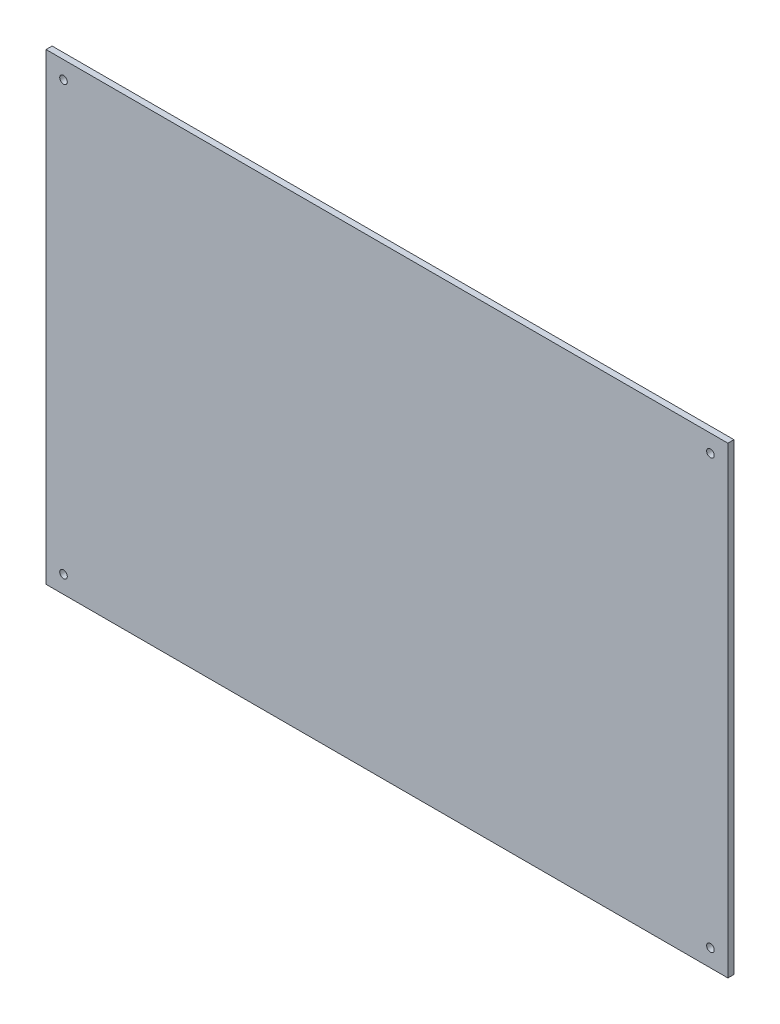
ISO-10303-21;
HEADER;
FILE_DESCRIPTION(('STEP AP214'),'2;1');
FILE_NAME('part.step','',(''),(''),'','','');
FILE_SCHEMA(('AUTOMOTIVE_DESIGN { 1 0 10303 214 1 1 1 1 }'));
ENDSEC;
DATA;
#1=APPLICATION_CONTEXT('core data for automotive mechanical design processes');
#2=APPLICATION_PROTOCOL_DEFINITION('international standard','automotive_design',2000,#1);
#3=PRODUCT_CONTEXT('',#1,'mechanical');
#4=PRODUCT('Part','Part','',(#3));
#5=PRODUCT_RELATED_PRODUCT_CATEGORY('part','',(#4));
#6=PRODUCT_DEFINITION_FORMATION('','',#4);
#7=PRODUCT_DEFINITION_CONTEXT('part definition',#1,'design');
#8=PRODUCT_DEFINITION('design','',#6,#7);
#9=PRODUCT_DEFINITION_SHAPE('','',#8);
#10=(LENGTH_UNIT() NAMED_UNIT(*) SI_UNIT(.MILLI.,.METRE.));
#11=(NAMED_UNIT(*) PLANE_ANGLE_UNIT() SI_UNIT($,.RADIAN.));
#12=(NAMED_UNIT(*) SI_UNIT($,.STERADIAN.) SOLID_ANGLE_UNIT());
#13=UNCERTAINTY_MEASURE_WITH_UNIT(LENGTH_MEASURE(1.E-05),#10,'distance_accuracy_value','');
#14=(GEOMETRIC_REPRESENTATION_CONTEXT(3) GLOBAL_UNCERTAINTY_ASSIGNED_CONTEXT((#13)) GLOBAL_UNIT_ASSIGNED_CONTEXT((#10,
#11,#12)) REPRESENTATION_CONTEXT('',''));
#15=CARTESIAN_POINT('',(0.,0.,0.));
#16=DIRECTION('',(0.,0.,1.));
#17=DIRECTION('',(1.,0.,0.));
#18=AXIS2_PLACEMENT_3D('',#15,#16,#17);
#19=CARTESIAN_POINT('',(0.,0.,4.));
#20=DIRECTION('',(0.,0.,1.));
#21=DIRECTION('',(1.,0.,0.));
#22=AXIS2_PLACEMENT_3D('',#19,#20,#21);
#23=PLANE('',#22);
#24=CARTESIAN_POINT('',(-11.5000000000001,293.5,4.));
#25=DIRECTION('',(0.,0.,1.));
#26=DIRECTION('',(-1.,0.,0.));
#27=AXIS2_PLACEMENT_3D('',#24,#25,#26);
#28=CIRCLE('',#27,2.50000000000002);
#29=CARTESIAN_POINT('',(-14.0000000000001,293.5,4.));
#30=VERTEX_POINT('',#29);
#31=EDGE_CURVE('E156',#30,#30,#28,.T.);
#32=ORIENTED_EDGE('',*,*,#31,.F.);
#33=EDGE_LOOP('',(#32));
#34=FACE_BOUND('',#33,.T.);
#35=CARTESIAN_POINT('',(-437.5,293.5,4.));
#36=DIRECTION('',(0.,0.,1.));
#37=DIRECTION('',(1.,0.,0.));
#38=AXIS2_PLACEMENT_3D('',#35,#36,#37);
#39=CIRCLE('',#38,2.50000000000002);
#40=CARTESIAN_POINT('',(-435.,293.5,4.));
#41=VERTEX_POINT('',#40);
#42=EDGE_CURVE('E119',#41,#41,#39,.T.);
#43=ORIENTED_EDGE('',*,*,#42,.F.);
#44=EDGE_LOOP('',(#43));
#45=FACE_BOUND('',#44,.T.);
#46=DIRECTION('',(0.,1.,0.));
#47=VECTOR('',#46,1.);
#48=CARTESIAN_POINT('',(0.,0.,4.));
#49=LINE('',#48,#47);
#50=CARTESIAN_POINT('',(0.,0.,4.));
#51=VERTEX_POINT('',#50);
#52=CARTESIAN_POINT('',(-1.11022302462516E-13,305.,4.));
#53=VERTEX_POINT('',#52);
#54=EDGE_CURVE('E99',#51,#53,#49,.T.);
#55=ORIENTED_EDGE('',*,*,#54,.T.);
#56=DIRECTION('',(-1.,0.,0.));
#57=VECTOR('',#56,1.);
#58=CARTESIAN_POINT('',(-1.11022302462516E-13,305.,4.));
#59=LINE('',#58,#57);
#60=CARTESIAN_POINT('',(-449.,305.,4.));
#61=VERTEX_POINT('',#60);
#62=EDGE_CURVE('E94',#53,#61,#59,.T.);
#63=ORIENTED_EDGE('',*,*,#62,.T.);
#64=DIRECTION('',(0.,-1.,0.));
#65=VECTOR('',#64,1.);
#66=CARTESIAN_POINT('',(-449.,0.,4.));
#67=LINE('',#66,#65);
#68=CARTESIAN_POINT('',(-449.,0.,4.));
#69=VERTEX_POINT('',#68);
#70=EDGE_CURVE('E97',#61,#69,#67,.T.);
#71=ORIENTED_EDGE('',*,*,#70,.T.);
#72=DIRECTION('',(1.,0.,0.));
#73=VECTOR('',#72,1.);
#74=CARTESIAN_POINT('',(0.,0.,4.));
#75=LINE('',#74,#73);
#76=EDGE_CURVE('E63',#69,#51,#75,.T.);
#77=ORIENTED_EDGE('',*,*,#76,.T.);
#78=EDGE_LOOP('',(#55,#63,#71,#77));
#79=FACE_BOUND('',#78,.T.);
#80=CARTESIAN_POINT('',(-437.5,11.5,4.));
#81=DIRECTION('',(0.,0.,1.));
#82=DIRECTION('',(-1.,0.,0.));
#83=AXIS2_PLACEMENT_3D('',#80,#81,#82);
#84=CIRCLE('',#83,2.50000000000002);
#85=CARTESIAN_POINT('',(-440.,11.5,4.));
#86=VERTEX_POINT('',#85);
#87=EDGE_CURVE('E142',#86,#86,#84,.T.);
#88=ORIENTED_EDGE('',*,*,#87,.F.);
#89=EDGE_LOOP('',(#88));
#90=FACE_BOUND('',#89,.T.);
#91=CARTESIAN_POINT('',(-11.5000000000001,11.5,4.));
#92=DIRECTION('',(0.,0.,1.));
#93=DIRECTION('',(1.,0.,0.));
#94=AXIS2_PLACEMENT_3D('',#91,#92,#93);
#95=CIRCLE('',#94,2.50000000000002);
#96=CARTESIAN_POINT('',(-9.00000000000005,11.5,4.));
#97=VERTEX_POINT('',#96);
#98=EDGE_CURVE('E157',#97,#97,#95,.T.);
#99=ORIENTED_EDGE('',*,*,#98,.F.);
#100=EDGE_LOOP('',(#99));
#101=FACE_BOUND('',#100,.T.);
#102=ADVANCED_FACE('F45',(#34,#45,#79,#90,#101),#23,.T.);
#103=CARTESIAN_POINT('',(0.,0.,0.));
#104=DIRECTION('',(0.,0.,1.));
#105=DIRECTION('',(1.,0.,0.));
#106=AXIS2_PLACEMENT_3D('',#103,#104,#105);
#107=PLANE('',#106);
#108=DIRECTION('',(0.,1.,0.));
#109=VECTOR('',#108,1.);
#110=CARTESIAN_POINT('',(0.,0.,0.));
#111=LINE('',#110,#109);
#112=CARTESIAN_POINT('',(0.,0.,0.));
#113=VERTEX_POINT('',#112);
#114=CARTESIAN_POINT('',(-1.11022302462516E-13,305.,0.));
#115=VERTEX_POINT('',#114);
#116=EDGE_CURVE('E115',#113,#115,#111,.T.);
#117=ORIENTED_EDGE('',*,*,#116,.F.);
#118=DIRECTION('',(1.,0.,0.));
#119=VECTOR('',#118,1.);
#120=CARTESIAN_POINT('',(0.,0.,0.));
#121=LINE('',#120,#119);
#122=CARTESIAN_POINT('',(-449.,0.,0.));
#123=VERTEX_POINT('',#122);
#124=EDGE_CURVE('E87',#123,#113,#121,.T.);
#125=ORIENTED_EDGE('',*,*,#124,.F.);
#126=DIRECTION('',(0.,-1.,0.));
#127=VECTOR('',#126,1.);
#128=CARTESIAN_POINT('',(-449.,0.,0.));
#129=LINE('',#128,#127);
#130=CARTESIAN_POINT('',(-449.,305.,0.));
#131=VERTEX_POINT('',#130);
#132=EDGE_CURVE('E81',#131,#123,#129,.T.);
#133=ORIENTED_EDGE('',*,*,#132,.F.);
#134=DIRECTION('',(-1.,0.,0.));
#135=VECTOR('',#134,1.);
#136=CARTESIAN_POINT('',(-1.11022302462516E-13,305.,0.));
#137=LINE('',#136,#135);
#138=EDGE_CURVE('E104',#115,#131,#137,.T.);
#139=ORIENTED_EDGE('',*,*,#138,.F.);
#140=EDGE_LOOP('',(#117,#125,#133,#139));
#141=FACE_BOUND('',#140,.T.);
#142=CARTESIAN_POINT('',(-437.5,293.5,0.));
#143=DIRECTION('',(0.,0.,1.));
#144=DIRECTION('',(1.,0.,0.));
#145=AXIS2_PLACEMENT_3D('',#142,#143,#144);
#146=CIRCLE('',#145,2.50000000000002);
#147=CARTESIAN_POINT('',(-435.,293.5,0.));
#148=VERTEX_POINT('',#147);
#149=EDGE_CURVE('E137',#148,#148,#146,.T.);
#150=ORIENTED_EDGE('',*,*,#149,.T.);
#151=EDGE_LOOP('',(#150));
#152=FACE_BOUND('',#151,.T.);
#153=CARTESIAN_POINT('',(-437.5,11.5,0.));
#154=DIRECTION('',(0.,0.,1.));
#155=DIRECTION('',(-1.,0.,0.));
#156=AXIS2_PLACEMENT_3D('',#153,#154,#155);
#157=CIRCLE('',#156,2.50000000000002);
#158=CARTESIAN_POINT('',(-440.,11.5,0.));
#159=VERTEX_POINT('',#158);
#160=EDGE_CURVE('E161',#159,#159,#157,.T.);
#161=ORIENTED_EDGE('',*,*,#160,.T.);
#162=EDGE_LOOP('',(#161));
#163=FACE_BOUND('',#162,.T.);
#164=CARTESIAN_POINT('',(-11.5000000000001,293.5,0.));
#165=DIRECTION('',(0.,0.,1.));
#166=DIRECTION('',(-1.,0.,0.));
#167=AXIS2_PLACEMENT_3D('',#164,#165,#166);
#168=CIRCLE('',#167,2.50000000000002);
#169=CARTESIAN_POINT('',(-14.0000000000001,293.5,0.));
#170=VERTEX_POINT('',#169);
#171=EDGE_CURVE('E150',#170,#170,#168,.T.);
#172=ORIENTED_EDGE('',*,*,#171,.T.);
#173=EDGE_LOOP('',(#172));
#174=FACE_BOUND('',#173,.T.);
#175=CARTESIAN_POINT('',(-11.5000000000001,11.5,0.));
#176=DIRECTION('',(0.,0.,1.));
#177=DIRECTION('',(1.,0.,0.));
#178=AXIS2_PLACEMENT_3D('',#175,#176,#177);
#179=CIRCLE('',#178,2.50000000000002);
#180=CARTESIAN_POINT('',(-9.00000000000005,11.5,0.));
#181=VERTEX_POINT('',#180);
#182=EDGE_CURVE('E195',#181,#181,#179,.T.);
#183=ORIENTED_EDGE('',*,*,#182,.T.);
#184=EDGE_LOOP('',(#183));
#185=FACE_BOUND('',#184,.T.);
#186=ADVANCED_FACE('F132',(#141,#152,#163,#174,#185),#107,.F.);
#187=CARTESIAN_POINT('',(0.,0.,4.));
#188=DIRECTION('',(-1.,0.,0.));
#189=DIRECTION('',(0.,-1.,0.));
#190=AXIS2_PLACEMENT_3D('',#187,#188,#189);
#191=PLANE('',#190);
#192=ORIENTED_EDGE('',*,*,#116,.T.);
#193=DIRECTION('',(0.,0.,-1.));
#194=VECTOR('',#193,1.);
#195=CARTESIAN_POINT('',(-1.11022302462516E-13,305.,4.));
#196=LINE('',#195,#194);
#197=EDGE_CURVE('E12',#53,#115,#196,.T.);
#198=ORIENTED_EDGE('',*,*,#197,.F.);
#199=ORIENTED_EDGE('',*,*,#54,.F.);
#200=DIRECTION('',(0.,0.,-1.));
#201=VECTOR('',#200,1.);
#202=CARTESIAN_POINT('',(0.,0.,4.));
#203=LINE('',#202,#201);
#204=EDGE_CURVE('E111',#51,#113,#203,.T.);
#205=ORIENTED_EDGE('',*,*,#204,.T.);
#206=EDGE_LOOP('',(#192,#198,#199,#205));
#207=FACE_BOUND('',#206,.T.);
#208=ADVANCED_FACE('F47',(#207),#191,.F.);
#209=CARTESIAN_POINT('',(-1.11022302462516E-13,305.,4.));
#210=DIRECTION('',(0.,-1.,0.));
#211=DIRECTION('',(1.,0.,0.));
#212=AXIS2_PLACEMENT_3D('',#209,#210,#211);
#213=PLANE('',#212);
#214=ORIENTED_EDGE('',*,*,#138,.T.);
#215=DIRECTION('',(0.,0.,-1.));
#216=VECTOR('',#215,1.);
#217=CARTESIAN_POINT('',(-449.,305.,4.));
#218=LINE('',#217,#216);
#219=EDGE_CURVE('E55',#61,#131,#218,.T.);
#220=ORIENTED_EDGE('',*,*,#219,.F.);
#221=ORIENTED_EDGE('',*,*,#62,.F.);
#222=ORIENTED_EDGE('',*,*,#197,.T.);
#223=EDGE_LOOP('',(#214,#220,#221,#222));
#224=FACE_BOUND('',#223,.T.);
#225=ADVANCED_FACE('F103',(#224),#213,.F.);
#226=CARTESIAN_POINT('',(-449.,0.,4.));
#227=DIRECTION('',(1.,0.,0.));
#228=DIRECTION('',(0.,1.,0.));
#229=AXIS2_PLACEMENT_3D('',#226,#227,#228);
#230=PLANE('',#229);
#231=ORIENTED_EDGE('',*,*,#132,.T.);
#232=DIRECTION('',(0.,0.,-1.));
#233=VECTOR('',#232,1.);
#234=CARTESIAN_POINT('',(-449.,0.,4.));
#235=LINE('',#234,#233);
#236=EDGE_CURVE('E106',#69,#123,#235,.T.);
#237=ORIENTED_EDGE('',*,*,#236,.F.);
#238=ORIENTED_EDGE('',*,*,#70,.F.);
#239=ORIENTED_EDGE('',*,*,#219,.T.);
#240=EDGE_LOOP('',(#231,#237,#238,#239));
#241=FACE_BOUND('',#240,.T.);
#242=ADVANCED_FACE('F107',(#241),#230,.F.);
#243=CARTESIAN_POINT('',(0.,0.,4.));
#244=DIRECTION('',(0.,1.,0.));
#245=DIRECTION('',(-1.,0.,0.));
#246=AXIS2_PLACEMENT_3D('',#243,#244,#245);
#247=PLANE('',#246);
#248=ORIENTED_EDGE('',*,*,#124,.T.);
#249=ORIENTED_EDGE('',*,*,#204,.F.);
#250=ORIENTED_EDGE('',*,*,#76,.F.);
#251=ORIENTED_EDGE('',*,*,#236,.T.);
#252=EDGE_LOOP('',(#248,#249,#250,#251));
#253=FACE_BOUND('',#252,.T.);
#254=ADVANCED_FACE('F129',(#253),#247,.F.);
#255=CARTESIAN_POINT('',(-437.5,293.5,4.));
#256=DIRECTION('',(0.,0.,-1.));
#257=DIRECTION('',(-1.,0.,0.));
#258=AXIS2_PLACEMENT_3D('',#255,#256,#257);
#259=CYLINDRICAL_SURFACE('',#258,2.50000000000002);
#260=ORIENTED_EDGE('',*,*,#42,.T.);
#261=EDGE_LOOP('',(#260));
#262=FACE_BOUND('',#261,.T.);
#263=ORIENTED_EDGE('',*,*,#149,.F.);
#264=EDGE_LOOP('',(#263));
#265=FACE_BOUND('',#264,.T.);
#266=ADVANCED_FACE('F182',(#262,#265),#259,.F.);
#267=CARTESIAN_POINT('',(-437.5,11.5,4.));
#268=DIRECTION('',(0.,0.,-1.));
#269=DIRECTION('',(-1.,0.,0.));
#270=AXIS2_PLACEMENT_3D('',#267,#268,#269);
#271=CYLINDRICAL_SURFACE('',#270,2.50000000000002);
#272=ORIENTED_EDGE('',*,*,#87,.T.);
#273=EDGE_LOOP('',(#272));
#274=FACE_BOUND('',#273,.T.);
#275=ORIENTED_EDGE('',*,*,#160,.F.);
#276=EDGE_LOOP('',(#275));
#277=FACE_BOUND('',#276,.T.);
#278=ADVANCED_FACE('F185',(#274,#277),#271,.F.);
#279=CARTESIAN_POINT('',(-11.5000000000001,293.5,4.));
#280=DIRECTION('',(0.,0.,-1.));
#281=DIRECTION('',(-1.,0.,0.));
#282=AXIS2_PLACEMENT_3D('',#279,#280,#281);
#283=CYLINDRICAL_SURFACE('',#282,2.50000000000002);
#284=ORIENTED_EDGE('',*,*,#31,.T.);
#285=EDGE_LOOP('',(#284));
#286=FACE_BOUND('',#285,.T.);
#287=ORIENTED_EDGE('',*,*,#171,.F.);
#288=EDGE_LOOP('',(#287));
#289=FACE_BOUND('',#288,.T.);
#290=ADVANCED_FACE('F172',(#286,#289),#283,.F.);
#291=CARTESIAN_POINT('',(-11.5000000000001,11.5,4.));
#292=DIRECTION('',(0.,0.,-1.));
#293=DIRECTION('',(-1.,0.,0.));
#294=AXIS2_PLACEMENT_3D('',#291,#292,#293);
#295=CYLINDRICAL_SURFACE('',#294,2.50000000000002);
#296=ORIENTED_EDGE('',*,*,#98,.T.);
#297=EDGE_LOOP('',(#296));
#298=FACE_BOUND('',#297,.T.);
#299=ORIENTED_EDGE('',*,*,#182,.F.);
#300=EDGE_LOOP('',(#299));
#301=FACE_BOUND('',#300,.T.);
#302=ADVANCED_FACE('F203',(#298,#301),#295,.F.);
#303=CLOSED_SHELL('',(#102,#186,#208,#225,#242,#254,#266,#278,#290,#302));
#304=MANIFOLD_SOLID_BREP('B2',#303);
#305=ADVANCED_BREP_SHAPE_REPRESENTATION('',(#18,#304),#14);
#306=SHAPE_DEFINITION_REPRESENTATION(#9,#305);
ENDSEC;
END-ISO-10303-21;
